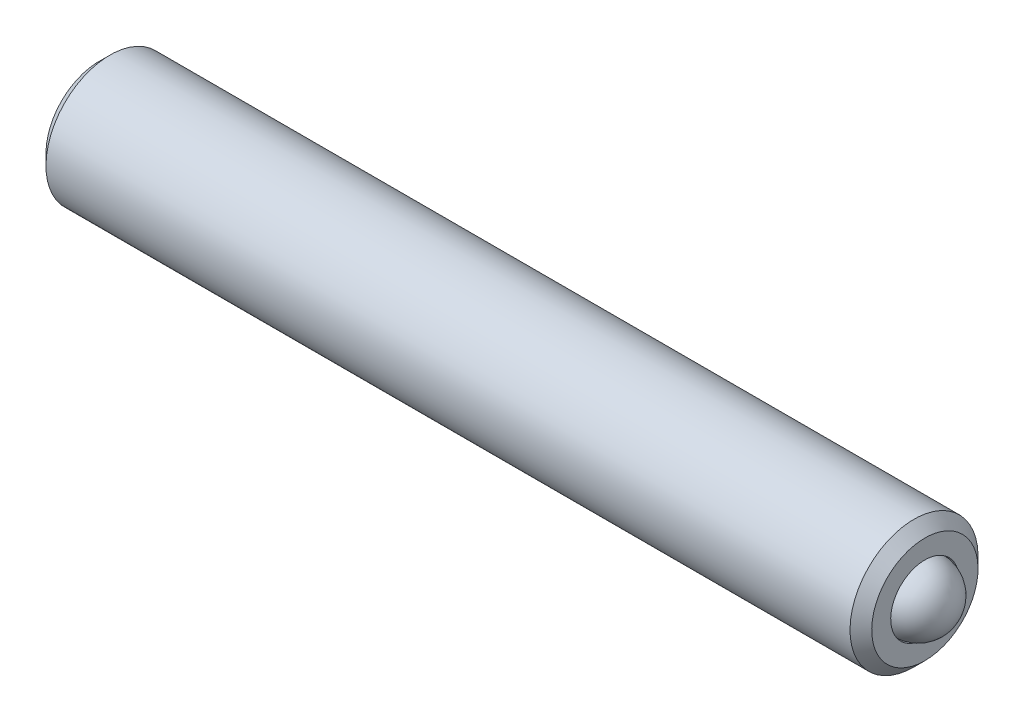
ISO-10303-21;
HEADER;
FILE_DESCRIPTION(('STEP AP214'),'2;1');
FILE_NAME('part.step','',(''),(''),'','','');
FILE_SCHEMA(('AUTOMOTIVE_DESIGN { 1 0 10303 214 1 1 1 1 }'));
ENDSEC;
DATA;
#1=APPLICATION_CONTEXT('core data for automotive mechanical design processes');
#2=APPLICATION_PROTOCOL_DEFINITION('international standard','automotive_design',2000,#1);
#3=PRODUCT_CONTEXT('',#1,'mechanical');
#4=PRODUCT('Part','Part','',(#3));
#5=PRODUCT_RELATED_PRODUCT_CATEGORY('part','',(#4));
#6=PRODUCT_DEFINITION_FORMATION('','',#4);
#7=PRODUCT_DEFINITION_CONTEXT('part definition',#1,'design');
#8=PRODUCT_DEFINITION('design','',#6,#7);
#9=PRODUCT_DEFINITION_SHAPE('','',#8);
#10=(LENGTH_UNIT() NAMED_UNIT(*) SI_UNIT(.MILLI.,.METRE.));
#11=(NAMED_UNIT(*) PLANE_ANGLE_UNIT() SI_UNIT($,.RADIAN.));
#12=(NAMED_UNIT(*) SI_UNIT($,.STERADIAN.) SOLID_ANGLE_UNIT());
#13=UNCERTAINTY_MEASURE_WITH_UNIT(LENGTH_MEASURE(1.E-05),#10,'distance_accuracy_value','');
#14=(GEOMETRIC_REPRESENTATION_CONTEXT(3) GLOBAL_UNCERTAINTY_ASSIGNED_CONTEXT((#13)) GLOBAL_UNIT_ASSIGNED_CONTEXT((#10,
#11,#12)) REPRESENTATION_CONTEXT('',''));
#15=CARTESIAN_POINT('',(0.,0.,0.));
#16=DIRECTION('',(0.,0.,1.));
#17=DIRECTION('',(1.,0.,0.));
#18=AXIS2_PLACEMENT_3D('',#15,#16,#17);
#19=CARTESIAN_POINT('',(-9.11632661303997,-31.3076582156983,10.0438104659588));
#20=DIRECTION('',(-1.,0.,0.));
#21=DIRECTION('',(0.,-1.,0.));
#22=AXIS2_PLACEMENT_3D('',#19,#20,#21);
#23=PLANE('',#22);
#24=CARTESIAN_POINT('',(-9.11632661303998,-15.4586747202075,10.0438104659588));
#25=DIRECTION('',(-1.,0.,0.));
#26=DIRECTION('',(0.,0.,1.));
#27=AXIS2_PLACEMENT_3D('',#24,#25,#26);
#28=CIRCLE('',#27,0.952500000000023);
#29=CARTESIAN_POINT('',(-9.11632661303998,-15.4586747202075,10.9963104659588));
#30=VERTEX_POINT('',#29);
#31=EDGE_CURVE('P0_E229',#30,#30,#28,.T.);
#32=ORIENTED_EDGE('',*,*,#31,.F.);
#33=EDGE_LOOP('',(#32));
#34=FACE_BOUND('',#33,.T.);
#35=CARTESIAN_POINT('',(-9.11632661303998,-15.4586747202075,10.0438104659588));
#36=DIRECTION('',(-1.,0.,0.));
#37=DIRECTION('',(0.,-1.,0.));
#38=AXIS2_PLACEMENT_3D('',#35,#36,#37);
#39=CIRCLE('',#38,1.24460000000001);
#40=CARTESIAN_POINT('',(-9.11632661303998,-16.7032747202075,10.0438104659588));
#41=VERTEX_POINT('',#40);
#42=EDGE_CURVE('P0_E102',#41,#41,#39,.T.);
#43=ORIENTED_EDGE('',*,*,#42,.T.);
#44=EDGE_LOOP('',(#43));
#45=FACE_BOUND('',#44,.T.);
#46=ADVANCED_FACE('P0_F17',(#34,#45),#23,.T.);
#47=CARTESIAN_POINT('',(8.93814137182635,-15.4586747202074,10.0438104659588));
#48=DIRECTION('',(1.,0.,0.));
#49=DIRECTION('',(0.,1.,0.));
#50=AXIS2_PLACEMENT_3D('',#47,#48,#49);
#51=CONICAL_SURFACE('',#50,0.,0.785398163397458);
#52=CARTESIAN_POINT('',(9.73824137182635,-15.4586747202074,10.0438104659588));
#53=DIRECTION('',(-1.,0.,0.));
#54=DIRECTION('',(0.,-1.,0.));
#55=AXIS2_PLACEMENT_3D('',#52,#53,#54);
#56=CIRCLE('',#55,0.800100000000015);
#57=CARTESIAN_POINT('',(9.73824137182635,-16.2587747202075,10.0438104659588));
#58=VERTEX_POINT('',#57);
#59=EDGE_CURVE('P0_E29',#58,#58,#56,.T.);
#60=ORIENTED_EDGE('',*,*,#59,.F.);
#61=EDGE_LOOP('',(#60));
#62=FACE_BOUND('',#61,.T.);
#63=CARTESIAN_POINT('',(8.93814137182635,-15.4586747202074,10.0438104659588));
#64=VERTEX_POINT('',#63);
#65=VERTEX_LOOP('',#64);
#66=FACE_BOUND('',#65,.T.);
#67=ADVANCED_FACE('P0_F121',(#62,#66),#51,.F.);
#68=CARTESIAN_POINT('',(-9.11632661303998,-15.4586747202075,10.0438104659588));
#69=DIRECTION('',(-1.,0.,0.));
#70=DIRECTION('',(0.,-1.,0.));
#71=AXIS2_PLACEMENT_3D('',#68,#69,#70);
#72=CYLINDRICAL_SURFACE('',#71,0.800100000000021);
#73=CARTESIAN_POINT('',(10.21942338696,-15.4586747202074,10.0438104659588));
#74=DIRECTION('',(-1.,0.,0.));
#75=DIRECTION('',(0.,-1.,0.));
#76=AXIS2_PLACEMENT_3D('',#73,#74,#75);
#77=CIRCLE('',#76,0.800100000000027);
#78=CARTESIAN_POINT('',(10.21942338696,-16.2587747202075,10.0438104659588));
#79=VERTEX_POINT('',#78);
#80=EDGE_CURVE('P0_E114',#79,#79,#77,.T.);
#81=ORIENTED_EDGE('',*,*,#80,.F.);
#82=EDGE_LOOP('',(#81));
#83=FACE_BOUND('',#82,.T.);
#84=ORIENTED_EDGE('',*,*,#59,.T.);
#85=EDGE_LOOP('',(#84));
#86=FACE_BOUND('',#85,.T.);
#87=ADVANCED_FACE('P0_F119',(#83,#86),#72,.F.);
#88=CARTESIAN_POINT('',(10.21942338696,-31.307658215698,10.0438104659588));
#89=DIRECTION('',(-1.,0.,0.));
#90=DIRECTION('',(0.,-1.,0.));
#91=AXIS2_PLACEMENT_3D('',#88,#89,#90);
#92=PLANE('',#91);
#93=CARTESIAN_POINT('',(10.21942338696,-15.4586747202074,10.0438104659588));
#94=DIRECTION('',(-1.,0.,0.));
#95=DIRECTION('',(0.,-1.,0.));
#96=AXIS2_PLACEMENT_3D('',#93,#94,#95);
#97=CIRCLE('',#96,1.24460000000001);
#98=CARTESIAN_POINT('',(10.21942338696,-16.7032747202075,10.0438104659588));
#99=VERTEX_POINT('',#98);
#100=EDGE_CURVE('P0_E111',#99,#99,#97,.T.);
#101=ORIENTED_EDGE('',*,*,#100,.F.);
#102=EDGE_LOOP('',(#101));
#103=FACE_BOUND('',#102,.T.);
#104=ORIENTED_EDGE('',*,*,#80,.T.);
#105=EDGE_LOOP('',(#104));
#106=FACE_BOUND('',#105,.T.);
#107=ADVANCED_FACE('P0_F128',(#103,#106),#92,.F.);
#108=CARTESIAN_POINT('',(10.21942338696,-15.4586747202074,10.0438104659588));
#109=DIRECTION('',(-1.,0.,0.));
#110=DIRECTION('',(0.,-1.,0.));
#111=AXIS2_PLACEMENT_3D('',#108,#109,#110);
#112=CONICAL_SURFACE('',#111,1.24460000000001,0.785398163397435);
#113=CARTESIAN_POINT('',(9.96542338696,-15.4586747202074,10.0438104659588));
#114=DIRECTION('',(-1.,0.,0.));
#115=DIRECTION('',(0.,-1.,0.));
#116=AXIS2_PLACEMENT_3D('',#113,#114,#115);
#117=CIRCLE('',#116,1.4986);
#118=CARTESIAN_POINT('',(9.96542338696,-16.9572747202074,10.0438104659588));
#119=VERTEX_POINT('',#118);
#120=EDGE_CURVE('P0_E108',#119,#119,#117,.T.);
#121=ORIENTED_EDGE('',*,*,#120,.F.);
#122=EDGE_LOOP('',(#121));
#123=FACE_BOUND('',#122,.T.);
#124=ORIENTED_EDGE('',*,*,#100,.T.);
#125=EDGE_LOOP('',(#124));
#126=FACE_BOUND('',#125,.T.);
#127=ADVANCED_FACE('P0_F135',(#123,#126),#112,.T.);
#128=CARTESIAN_POINT('',(-9.11632661303998,-15.4586747202075,10.0438104659588));
#129=DIRECTION('',(-1.,0.,0.));
#130=DIRECTION('',(0.,-1.,0.));
#131=AXIS2_PLACEMENT_3D('',#128,#129,#130);
#132=CYLINDRICAL_SURFACE('',#131,1.49860000000001);
#133=CARTESIAN_POINT('',(-8.86232661304,-15.4586747202075,10.0438104659588));
#134=DIRECTION('',(-1.,0.,0.));
#135=DIRECTION('',(0.,-1.,0.));
#136=AXIS2_PLACEMENT_3D('',#133,#134,#135);
#137=CIRCLE('',#136,1.49860000000002);
#138=CARTESIAN_POINT('',(-8.86232661304,-16.9572747202075,10.0438104659588));
#139=VERTEX_POINT('',#138);
#140=EDGE_CURVE('P0_E105',#139,#139,#137,.T.);
#141=ORIENTED_EDGE('',*,*,#140,.F.);
#142=EDGE_LOOP('',(#141));
#143=FACE_BOUND('',#142,.T.);
#144=ORIENTED_EDGE('',*,*,#120,.T.);
#145=EDGE_LOOP('',(#144));
#146=FACE_BOUND('',#145,.T.);
#147=ADVANCED_FACE('P0_F139',(#143,#146),#132,.T.);
#148=CARTESIAN_POINT('',(-9.11632661303998,-15.4586747202075,10.0438104659588));
#149=DIRECTION('',(1.,0.,0.));
#150=DIRECTION('',(0.,1.,0.));
#151=AXIS2_PLACEMENT_3D('',#148,#149,#150);
#152=CONICAL_SURFACE('',#151,1.24460000000001,0.785398163397501);
#153=ORIENTED_EDGE('',*,*,#140,.T.);
#154=EDGE_LOOP('',(#153));
#155=FACE_BOUND('',#154,.T.);
#156=ORIENTED_EDGE('',*,*,#42,.F.);
#157=EDGE_LOOP('',(#156));
#158=FACE_BOUND('',#157,.T.);
#159=ADVANCED_FACE('P0_F143',(#155,#158),#152,.T.);
#160=CARTESIAN_POINT('',(-9.11632661303998,-15.4586747202075,10.0438104659588));
#161=DIRECTION('',(-1.,0.,0.));
#162=DIRECTION('',(0.,0.,1.));
#163=AXIS2_PLACEMENT_3D('',#160,#161,#162);
#164=CONICAL_SURFACE('',#163,0.952500000000023,0.78539816339745);
#165=CARTESIAN_POINT('',(-8.91324210978124,-14.7092592501536,10.0436104659588));
#166=CARTESIAN_POINT('',(-8.90036552668412,-14.7221436917082,10.0659269733585));
#167=CARTESIAN_POINT('',(-8.88824360681818,-14.7352427617095,10.0886152281325));
#168=CARTESIAN_POINT('',(-8.8660478423221,-14.7619535243145,10.1348796260735));
#169=CARTESIAN_POINT('',(-8.8559863597231,-14.7755677618862,10.1584601772539));
#170=CARTESIAN_POINT('',(-8.83875279005604,-14.8030220192588,10.2060123459072));
#171=CARTESIAN_POINT('',(-8.83153730595256,-14.8168550074889,10.2299717843422));
#172=CARTESIAN_POINT('',(-8.82041116616375,-14.8448189375339,10.2784067319596));
#173=CARTESIAN_POINT('',(-8.81649222355141,-14.8589490401456,10.3028807875991));
#174=CARTESIAN_POINT('',(-8.81152027848902,-14.8934629424513,10.3626606199601));
#175=CARTESIAN_POINT('',(-8.81241981467698,-14.9139273587489,10.3981060287348));
#176=CARTESIAN_POINT('',(-8.82168835609727,-14.9544272337628,10.4682538699591));
#177=CARTESIAN_POINT('',(-8.83006851532351,-14.9744620061614,10.5029551136716));
#178=CARTESIAN_POINT('',(-8.85027759171018,-15.0096470609526,10.5638974162369));
#179=CARTESIAN_POINT('',(-8.86105231463503,-15.0249591014186,10.5904186482916));
#180=CARTESIAN_POINT('',(-8.88532522860185,-15.05498321834,10.6424219442519));
#181=CARTESIAN_POINT('',(-8.89881456058682,-15.069697063927,10.6679070723833));
#182=CARTESIAN_POINT('',(-8.91324210978125,-15.0841401902613,10.6929233010145));
#183=B_SPLINE_CURVE_WITH_KNOTS('',3,(#165,#166,#167,#168,#169,#170,#171,#172,#173,#174,#175,
#176,#177,#178,#179,#180,#181,#182),.UNSPECIFIED.,.F.,.F.,(4,2,2,2,2,2,2,2,4),(0.,
0.0864788641253348,0.173462284806161,0.259062693136943,0.344447268473221,0.466486555643631,
0.588708114182807,0.685962692863712,0.782904885826127),.UNSPECIFIED.);
#184=CARTESIAN_POINT('',(-8.91312661303994,-14.7093747202075,10.0438104659588));
#185=VERTEX_POINT('',#184);
#186=CARTESIAN_POINT('',(-8.91312661303995,-15.0840247202075,10.6927233010145));
#187=VERTEX_POINT('',#186);
#188=EDGE_CURVE('P0_E73',#185,#187,#183,.T.);
#189=ORIENTED_EDGE('',*,*,#188,.T.);
#190=CARTESIAN_POINT('',(-10.625365831982,-17.8331404409307,10.6927233010146));
#191=CARTESIAN_POINT('',(-10.5676233906691,-17.7732753543967,10.6927233010146));
#192=CARTESIAN_POINT('',(-10.5099544568804,-17.7133390335228,10.6927233010146));
#193=CARTESIAN_POINT('',(-10.394812634355,-17.5932722885365,10.6927233010146));
#194=CARTESIAN_POINT('',(-10.3373397562521,-17.5331418542297,10.6927233010146));
#195=CARTESIAN_POINT('',(-10.2224859996694,-17.4124743163553,10.6927233010146));
#196=CARTESIAN_POINT('',(-10.1651058198909,-17.3519365471764,10.6927233010146));
#197=CARTESIAN_POINT('',(-10.0506804651646,-17.2305496184344,10.6927233010145));
#198=CARTESIAN_POINT('',(-9.99363527654341,-17.1697004717732,10.6927233010145));
#199=CARTESIAN_POINT('',(-9.87285030409219,-17.0399113196522,10.6927233010145));
#200=CARTESIAN_POINT('',(-9.80917025165041,-16.9709156453989,10.6927233010145));
#201=CARTESIAN_POINT('',(-9.68262283886063,-16.8321624054756,10.6927233010145));
#202=CARTESIAN_POINT('',(-9.61975559128004,-16.7624047365126,10.6927233010145));
#203=CARTESIAN_POINT('',(-9.49539418508536,-16.6218832005999,10.6927233010145));
#204=CARTESIAN_POINT('',(-9.43389789106411,-16.551121227415,10.6927233010145));
#205=CARTESIAN_POINT('',(-9.31297282635876,-16.4078603499327,10.6927233010145));
#206=CARTESIAN_POINT('',(-9.25354342987335,-16.3353619827952,10.6927233010145));
#207=CARTESIAN_POINT('',(-9.16124131898772,-16.2166500294666,10.6927233010145));
#208=CARTESIAN_POINT('',(-9.12716145299634,-16.1713811088337,10.6927233010145));
#209=CARTESIAN_POINT('',(-9.06109231328958,-16.079191095272,10.6927233010145));
#210=CARTESIAN_POINT('',(-9.02910698039448,-16.0322671298609,10.6927233010145));
#211=CARTESIAN_POINT('',(-8.96925388706377,-15.9371815659038,10.6927233010145));
#212=CARTESIAN_POINT('',(-8.94131453850947,-15.8890657608937,10.6927233010145));
#213=CARTESIAN_POINT('',(-8.89117775254594,-15.7899851956988,10.6927233010145));
#214=CARTESIAN_POINT('',(-8.86895827956883,-15.7390323174389,10.6927233010145));
#215=CARTESIAN_POINT('',(-8.84086500723943,-15.6541543850305,10.6927233010145));
#216=CARTESIAN_POINT('',(-8.83199242909033,-15.621249431289,10.6927233010145));
#217=CARTESIAN_POINT('',(-8.81897483037496,-15.5545735546106,10.6927233010145));
#218=CARTESIAN_POINT('',(-8.81481688608121,-15.5208052597048,10.6927233010145));
#219=CARTESIAN_POINT('',(-8.81156103572243,-15.4453957674318,10.6927233010145));
#220=CARTESIAN_POINT('',(-8.81380762708482,-15.4036879375453,10.6927233010145));
#221=CARTESIAN_POINT('',(-8.82585350137422,-15.3212726784945,10.6927233010145));
#222=CARTESIAN_POINT('',(-8.83568593176981,-15.2805704511373,10.6927233010145));
#223=CARTESIAN_POINT('',(-8.85838039182137,-15.2092386381408,10.6927233010145));
#224=CARTESIAN_POINT('',(-8.87020379316485,-15.1782587618784,10.6927233010145));
#225=CARTESIAN_POINT('',(-8.89648430183203,-15.1174236567548,10.6927233010145));
#226=CARTESIAN_POINT('',(-8.91094357766406,-15.0875693784993,10.6927233010145));
#227=CARTESIAN_POINT('',(-8.94191965427765,-15.0285846038295,10.6927233010145));
#228=CARTESIAN_POINT('',(-8.95845556113873,-14.9994643133075,10.6927233010145));
#229=CARTESIAN_POINT('',(-8.99293362521959,-14.9420946784385,10.6927233010145));
#230=CARTESIAN_POINT('',(-9.01087516040214,-14.9138449564619,10.6927233010145));
#231=CARTESIAN_POINT('',(-9.05272883265954,-14.8505926862914,10.6927233010145));
#232=CARTESIAN_POINT('',(-9.07695646509125,-14.8158001535954,10.6927233010145));
#233=CARTESIAN_POINT('',(-9.12659192432341,-14.7470637044818,10.6927233010145));
#234=CARTESIAN_POINT('',(-9.15200001675405,-14.7131199817347,10.6927233010145));
#235=CARTESIAN_POINT('',(-9.22952501427839,-14.6122110344901,10.6927233010145));
#236=CARTESIAN_POINT('',(-9.28290618483535,-14.5462207483016,10.6927233010145));
#237=CARTESIAN_POINT('',(-9.39174266038033,-14.4156142258401,10.6927233010145));
#238=CARTESIAN_POINT('',(-9.44720447535384,-14.3510035043303,10.6927233010145));
#239=CARTESIAN_POINT('',(-9.55930313647575,-14.2228636229378,10.6927233010144));
#240=CARTESIAN_POINT('',(-9.61593943668301,-14.1593339844708,10.6927233010144));
#241=CARTESIAN_POINT('',(-9.72369583057836,-14.039984095558,10.6927233010144));
#242=CARTESIAN_POINT('',(-9.7747329297823,-13.98408856777,10.6927233010144));
#243=CARTESIAN_POINT('',(-9.87727186214808,-13.8727115978055,10.6927233010144));
#244=CARTESIAN_POINT('',(-9.92877375805026,-13.8172302134361,10.6927233010144));
#245=CARTESIAN_POINT('',(-10.0317734845372,-13.7069544109589,10.6927233010144));
#246=CARTESIAN_POINT('',(-10.0832690553368,-13.6521578787545,10.6927233010144));
#247=CARTESIAN_POINT('',(-10.1865141787423,-13.5428216802844,10.6927233010144));
#248=CARTESIAN_POINT('',(-10.2382636878373,-13.4882819729497,10.6927233010144));
#249=CARTESIAN_POINT('',(-10.2901078416566,-13.4338329990679,10.6927233010144));
#250=B_SPLINE_CURVE_WITH_KNOTS('',3,(#190,#191,#192,#193,#194,#195,#196,#197,#198,#199,#200,
#201,#202,#203,#204,#205,#206,#207,#208,#209,#210,#211,#212,#213,#214,#215,#216,#217,#218,#219,
#220,#221,#222,#223,#224,#225,#226,#227,#228,#229,#230,#231,#232,#233,#234,#235,#236,#237,#238,
#239,#240,#241,#242,#243,#244,#245,#246,#247,#248,#249),.UNSPECIFIED.,.F.,.F.,(4,2,2,2,2,2,2,2,
2,2,2,2,2,2,2,2,2,2,2,2,2,2,2,2,2,2,2,2,2,4),(0.,0.24952416944401,0.4990616640489,
0.749292126030621,0.999512302282482,1.28118188446105,1.56289013456254,1.8441236464603,
2.12527125365804,2.29522422452397,2.46548827885784,2.63222422359163,2.7983078735179,
2.90027530295208,3.00196253895412,3.12646325295125,3.25151109444024,3.35084711072832,
3.45026522165719,3.55067620712131,3.6510430056943,3.77819720424608,3.90538015527501,
4.15993807573824,4.41537266799788,4.67069107504129,4.89776066228902,5.12486137303368,
5.35044877312682,5.57599878315974),.UNSPECIFIED.);
#251=CARTESIAN_POINT('',(-8.91312661303996,-15.8333247202074,10.6927233010145));
#252=VERTEX_POINT('',#251);
#253=EDGE_CURVE('P0_E87',#187,#252,#250,.F.);
#254=ORIENTED_EDGE('',*,*,#253,.T.);
#255=CARTESIAN_POINT('',(-8.91324210978127,-15.8332092501536,10.6929233010145));
#256=CARTESIAN_POINT('',(-8.90036552668414,-15.8460936917082,10.6706067936148));
#257=CARTESIAN_POINT('',(-8.8882436068182,-15.8591927617094,10.6479185388408));
#258=CARTESIAN_POINT('',(-8.86604784232212,-15.8859035243145,10.6016541408998));
#259=CARTESIAN_POINT('',(-8.85598635972311,-15.8995177618862,10.5780735897194));
#260=CARTESIAN_POINT('',(-8.83875279005606,-15.9269720192587,10.530521421066));
#261=CARTESIAN_POINT('',(-8.83153730595257,-15.9408050074888,10.506561982631));
#262=CARTESIAN_POINT('',(-8.82041116616376,-15.9687689375339,10.4581270350137));
#263=CARTESIAN_POINT('',(-8.81649222355142,-15.9828990401455,10.4336529793741));
#264=CARTESIAN_POINT('',(-8.81152027848903,-16.0174129424513,10.3738731470132));
#265=CARTESIAN_POINT('',(-8.81241981467699,-16.0378773587488,10.3384277382385));
#266=CARTESIAN_POINT('',(-8.82168835609728,-16.0783772337628,10.2682798970141));
#267=CARTESIAN_POINT('',(-8.83006851532352,-16.0984120061614,10.2335786533017));
#268=CARTESIAN_POINT('',(-8.85027759171019,-16.1335970609525,10.1726363507363));
#269=CARTESIAN_POINT('',(-8.86105231463504,-16.1489091014186,10.1461151186816));
#270=CARTESIAN_POINT('',(-8.88532522860186,-16.17893321834,10.0941118227214));
#271=CARTESIAN_POINT('',(-8.89881456058682,-16.1936470639269,10.06862669459));
#272=CARTESIAN_POINT('',(-8.91324210978125,-16.2080901902613,10.0436104659588));
#273=B_SPLINE_CURVE_WITH_KNOTS('',3,(#255,#256,#257,#258,#259,#260,#261,#262,#263,#264,#265,
#266,#267,#268,#269,#270,#271,#272),.UNSPECIFIED.,.F.,.F.,(4,2,2,2,2,2,2,2,4),(0.,
0.0864788641253455,0.173462284806181,0.259062693136974,0.344447268473259,0.46648655564367,
0.588708114182849,0.685962692863737,0.78290488582614),.UNSPECIFIED.);
#274=CARTESIAN_POINT('',(-8.91312661303994,-16.2079747202074,10.0438104659588));
#275=VERTEX_POINT('',#274);
#276=EDGE_CURVE('P0_E184',#252,#275,#273,.T.);
#277=ORIENTED_EDGE('',*,*,#276,.T.);
#278=CARTESIAN_POINT('',(-8.91324210978122,-15.8332092501536,9.39469763090316));
#279=CARTESIAN_POINT('',(-8.9003655266841,-15.8460936917082,9.41701413830287));
#280=CARTESIAN_POINT('',(-8.88824360681816,-15.8591927617094,9.4397023930769));
#281=CARTESIAN_POINT('',(-8.86604784232209,-15.8859035243145,9.48596679101782));
#282=CARTESIAN_POINT('',(-8.85598635972309,-15.8995177618862,9.50954734219826));
#283=CARTESIAN_POINT('',(-8.83875279005604,-15.9269720192587,9.55709951085159));
#284=CARTESIAN_POINT('',(-8.83153730595255,-15.9408050074888,9.58105894928659));
#285=CARTESIAN_POINT('',(-8.82041116616374,-15.9687689375339,9.62949389690396));
#286=CARTESIAN_POINT('',(-8.81649222355141,-15.9828990401455,9.65396795254348));
#287=CARTESIAN_POINT('',(-8.81152027848902,-16.0174129424513,9.71374778490445));
#288=CARTESIAN_POINT('',(-8.81241981467698,-16.0378773587488,9.74919319367911));
#289=CARTESIAN_POINT('',(-8.82168835609727,-16.0783772337628,9.81934103490348));
#290=CARTESIAN_POINT('',(-8.83006851532351,-16.0984120061614,9.85404227861596));
#291=CARTESIAN_POINT('',(-8.85027759171018,-16.1335970609525,9.91498458118127));
#292=CARTESIAN_POINT('',(-8.86105231463503,-16.1489091014186,9.94150581323598));
#293=CARTESIAN_POINT('',(-8.88532522860185,-16.17893321834,9.99350910919622));
#294=CARTESIAN_POINT('',(-8.89881456058681,-16.1936470639269,10.0189942373276));
#295=CARTESIAN_POINT('',(-8.91324210978125,-16.2080901902613,10.0440104659588));
#296=B_SPLINE_CURVE_WITH_KNOTS('',3,(#278,#279,#280,#281,#282,#283,#284,#285,#286,#287,#288,
#289,#290,#291,#292,#293,#294,#295),.UNSPECIFIED.,.F.,.F.,(4,2,2,2,2,2,2,2,4),(0.,
0.0864788641253269,0.173462284806145,0.259062693136922,0.344447268473193,0.466486555643602,
0.588708114182777,0.68596269286368,0.78290488582609),.UNSPECIFIED.);
#297=CARTESIAN_POINT('',(-8.91312661303992,-15.8333247202075,9.39489763090316));
#298=VERTEX_POINT('',#297);
#299=EDGE_CURVE('P0_E179',#298,#275,#296,.T.);
#300=ORIENTED_EDGE('',*,*,#299,.F.);
#301=CARTESIAN_POINT('',(-10.625365831982,-17.8331404409307,9.39489763090316));
#302=CARTESIAN_POINT('',(-10.5676233906691,-17.7732753543968,9.39489763090316));
#303=CARTESIAN_POINT('',(-10.5099544568804,-17.7133390335228,9.39489763090316));
#304=CARTESIAN_POINT('',(-10.394812634355,-17.5932722885366,9.39489763090316));
#305=CARTESIAN_POINT('',(-10.337339756252,-17.5331418542297,9.39489763090316));
#306=CARTESIAN_POINT('',(-10.2224859996694,-17.4124743163553,9.39489763090316));
#307=CARTESIAN_POINT('',(-10.1651058198908,-17.3519365471764,9.39489763090316));
#308=CARTESIAN_POINT('',(-10.0506804651645,-17.2305496184344,9.39489763090316));
#309=CARTESIAN_POINT('',(-9.99363527654337,-17.1697004717732,9.39489763090316));
#310=CARTESIAN_POINT('',(-9.87285030409213,-17.0399113196522,9.39489763090316));
#311=CARTESIAN_POINT('',(-9.80917025165036,-16.9709156453988,9.39489763090316));
#312=CARTESIAN_POINT('',(-9.68262283886056,-16.8321624054756,9.39489763090316));
#313=CARTESIAN_POINT('',(-9.61975559127997,-16.7624047365126,9.39489763090316));
#314=CARTESIAN_POINT('',(-9.49539418508528,-16.6218832005998,9.39489763090316));
#315=CARTESIAN_POINT('',(-9.43389789106403,-16.5511212274149,9.39489763090316));
#316=CARTESIAN_POINT('',(-9.31297282635867,-16.4078603499326,9.39489763090316));
#317=CARTESIAN_POINT('',(-9.25354342987325,-16.3353619827951,9.39489763090316));
#318=CARTESIAN_POINT('',(-9.16124131898763,-16.2166500294666,9.39489763090316));
#319=CARTESIAN_POINT('',(-9.12716145299625,-16.1713811088337,9.39489763090316));
#320=CARTESIAN_POINT('',(-9.0610923132895,-16.079191095272,9.39489763090316));
#321=CARTESIAN_POINT('',(-9.0291069803944,-16.0322671298609,9.39489763090316));
#322=CARTESIAN_POINT('',(-8.96925388706371,-15.9371815659038,9.39489763090316));
#323=CARTESIAN_POINT('',(-8.94131453850941,-15.8890657608937,9.39489763090316));
#324=CARTESIAN_POINT('',(-8.89117775254589,-15.7899851956988,9.39489763090316));
#325=CARTESIAN_POINT('',(-8.86895827956878,-15.7390323174389,9.39489763090316));
#326=CARTESIAN_POINT('',(-8.84086500723938,-15.6541543850305,9.39489763090316));
#327=CARTESIAN_POINT('',(-8.83199242909028,-15.621249431289,9.39489763090316));
#328=CARTESIAN_POINT('',(-8.81897483037491,-15.5545735546106,9.39489763090316));
#329=CARTESIAN_POINT('',(-8.81481688608115,-15.5208052597048,9.39489763090316));
#330=CARTESIAN_POINT('',(-8.81156103572237,-15.4453957674319,9.39489763090316));
#331=CARTESIAN_POINT('',(-8.81380762708477,-15.4036879375454,9.39489763090316));
#332=CARTESIAN_POINT('',(-8.82585350137416,-15.3212726784946,9.39489763090316));
#333=CARTESIAN_POINT('',(-8.83568593176975,-15.2805704511374,9.39489763090316));
#334=CARTESIAN_POINT('',(-8.85838039182131,-15.2092386381409,9.39489763090316));
#335=CARTESIAN_POINT('',(-8.87020379316478,-15.1782587618785,9.39489763090316));
#336=CARTESIAN_POINT('',(-8.89648430183196,-15.1174236567549,9.39489763090316));
#337=CARTESIAN_POINT('',(-8.91094357766399,-15.0875693784994,9.39489763090316));
#338=CARTESIAN_POINT('',(-8.94191965427757,-15.0285846038296,9.39489763090316));
#339=CARTESIAN_POINT('',(-8.95845556113865,-14.9994643133076,9.39489763090316));
#340=CARTESIAN_POINT('',(-8.9929336252195,-14.9420946784386,9.39489763090316));
#341=CARTESIAN_POINT('',(-9.01087516040205,-14.913844956462,9.39489763090316));
#342=CARTESIAN_POINT('',(-9.05272883265945,-14.8505926862915,9.39489763090316));
#343=CARTESIAN_POINT('',(-9.07695646509116,-14.8158001535955,9.39489763090316));
#344=CARTESIAN_POINT('',(-9.12659192432331,-14.7470637044819,9.39489763090316));
#345=CARTESIAN_POINT('',(-9.15200001675395,-14.7131199817349,9.39489763090316));
#346=CARTESIAN_POINT('',(-9.22952501427827,-14.6122110344902,9.39489763090316));
#347=CARTESIAN_POINT('',(-9.28290618483523,-14.5462207483017,9.39489763090316));
#348=CARTESIAN_POINT('',(-9.39174266038019,-14.4156142258402,9.39489763090316));
#349=CARTESIAN_POINT('',(-9.44720447535369,-14.3510035043304,9.39489763090316));
#350=CARTESIAN_POINT('',(-9.55930313647559,-14.222863622938,9.39489763090316));
#351=CARTESIAN_POINT('',(-9.61593943668284,-14.159333984471,9.39489763090316));
#352=CARTESIAN_POINT('',(-9.72369583057817,-14.0399840955582,9.39489763090316));
#353=CARTESIAN_POINT('',(-9.77473292978211,-13.9840885677702,9.39489763090316));
#354=CARTESIAN_POINT('',(-9.87727186214787,-13.8727115978057,9.39489763090316));
#355=CARTESIAN_POINT('',(-9.92877375805004,-13.8172302134364,9.39489763090316));
#356=CARTESIAN_POINT('',(-10.031773484537,-13.7069544109592,9.39489763090316));
#357=CARTESIAN_POINT('',(-10.0832690553365,-13.6521578787548,9.39489763090316));
#358=CARTESIAN_POINT('',(-10.1865141787421,-13.5428216802847,9.39489763090316));
#359=CARTESIAN_POINT('',(-10.2382636878371,-13.48828197295,9.39489763090316));
#360=CARTESIAN_POINT('',(-10.2901078416563,-13.4338329990682,9.39489763090316));
#361=B_SPLINE_CURVE_WITH_KNOTS('',3,(#301,#302,#303,#304,#305,#306,#307,#308,#309,#310,#311,
#312,#313,#314,#315,#316,#317,#318,#319,#320,#321,#322,#323,#324,#325,#326,#327,#328,#329,#330,
#331,#332,#333,#334,#335,#336,#337,#338,#339,#340,#341,#342,#343,#344,#345,#346,#347,#348,#349,
#350,#351,#352,#353,#354,#355,#356,#357,#358,#359,#360),.UNSPECIFIED.,.F.,.F.,(4,2,2,2,2,2,2,2,
2,2,2,2,2,2,2,2,2,2,2,2,2,2,2,2,2,2,2,2,2,4),(0.,0.24952416944403,0.499061664048934,
0.749292126030675,0.999512302282552,1.28118188446114,1.56289013456265,1.84412364646043,
2.12527125365819,2.29522422452409,2.46548827885793,2.63222422359169,2.79830787351794,
2.90027530295211,3.00196253895414,3.12646325295126,3.25151109444025,3.35084711072832,
3.45026522165718,3.55067620712128,3.65104300569426,3.77819720424603,3.90538015527494,
4.15993807573814,4.41537266799773,4.67069107504112,4.89776066228881,5.12486137303344,
5.35044877312655,5.57599878315943),.UNSPECIFIED.);
#362=CARTESIAN_POINT('',(-8.91312661303992,-15.0840247202075,9.39489763090316));
#363=VERTEX_POINT('',#362);
#364=EDGE_CURVE('P0_E36',#363,#298,#361,.F.);
#365=ORIENTED_EDGE('',*,*,#364,.F.);
#366=CARTESIAN_POINT('',(-8.91324210978124,-14.7092592501536,10.0440104659588));
#367=CARTESIAN_POINT('',(-8.90036552668412,-14.7221436917082,10.0216939585591));
#368=CARTESIAN_POINT('',(-8.88824360681818,-14.7352427617095,9.99900570378506));
#369=CARTESIAN_POINT('',(-8.8660478423221,-14.7619535243145,9.95274130584414));
#370=CARTESIAN_POINT('',(-8.8559863597231,-14.7755677618862,9.92916075466369));
#371=CARTESIAN_POINT('',(-8.83875279005605,-14.8030220192588,9.88160858601036));
#372=CARTESIAN_POINT('',(-8.83153730595256,-14.8168550074889,9.85764914757536));
#373=CARTESIAN_POINT('',(-8.82041116616375,-14.8448189375339,9.80921419995799));
#374=CARTESIAN_POINT('',(-8.81649222355141,-14.8589490401456,9.78474014431846));
#375=CARTESIAN_POINT('',(-8.81152027848902,-14.8934629424513,9.72496031195749));
#376=CARTESIAN_POINT('',(-8.81241981467698,-14.9139273587489,9.68951490318283));
#377=CARTESIAN_POINT('',(-8.82168835609727,-14.9544272337628,9.61936706195847));
#378=CARTESIAN_POINT('',(-8.83006851532351,-14.9744620061614,9.58466581824598));
#379=CARTESIAN_POINT('',(-8.85027759171018,-15.0096470609526,9.52372351568068));
#380=CARTESIAN_POINT('',(-8.86105231463503,-15.0249591014186,9.49720228362597));
#381=CARTESIAN_POINT('',(-8.88532522860184,-15.05498321834,9.44519898766574));
#382=CARTESIAN_POINT('',(-8.8988145605868,-15.069697063927,9.41971385953436));
#383=CARTESIAN_POINT('',(-8.91324210978122,-15.0841401902613,9.39469763090316));
#384=B_SPLINE_CURVE_WITH_KNOTS('',3,(#366,#367,#368,#369,#370,#371,#372,#373,#374,#375,#376,
#377,#378,#379,#380,#381,#382,#383),.UNSPECIFIED.,.F.,.F.,(4,2,2,2,2,2,2,2,4),(0.,
0.0864788641253319,0.173462284806158,0.25906269313694,0.34444726847322,0.46648655564363,
0.588708114182806,0.685962692863685,0.782904885826073),.UNSPECIFIED.);
#385=EDGE_CURVE('P0_E11',#185,#363,#384,.T.);
#386=ORIENTED_EDGE('',*,*,#385,.F.);
#387=EDGE_LOOP('',(#189,#254,#277,#300,#365,#386));
#388=FACE_BOUND('',#387,.T.);
#389=ORIENTED_EDGE('',*,*,#31,.T.);
#390=EDGE_LOOP('',(#389));
#391=FACE_BOUND('',#390,.T.);
#392=ADVANCED_FACE('P0_F71',(#388,#391),#164,.F.);
#393=CARTESIAN_POINT('',(-6.06832661303998,-18.3382160764448,10.0438104659588));
#394=DIRECTION('',(-1.,0.,0.));
#395=DIRECTION('',(0.,-1.,0.));
#396=AXIS2_PLACEMENT_3D('',#393,#394,#395);
#397=PLANE('',#396);
#398=DIRECTION('',(0.,-0.500000000000001,0.866025403784438));
#399=VECTOR('',#398,1.);
#400=CARTESIAN_POINT('',(-6.06832661303998,-15.6165850592668,11.6151448663614));
#401=LINE('',#400,#399);
#402=CARTESIAN_POINT('',(-6.06832661303998,-14.7093747202075,10.0438104659588));
#403=VERTEX_POINT('',#402);
#404=CARTESIAN_POINT('',(-6.06832661303998,-15.0840247202075,10.6927233010145));
#405=VERTEX_POINT('',#404);
#406=EDGE_CURVE('P0_E86',#403,#405,#401,.T.);
#407=ORIENTED_EDGE('',*,*,#406,.F.);
#408=DIRECTION('',(0.,-0.500000000000001,-0.866025403784438));
#409=VECTOR('',#408,1.);
#410=CARTESIAN_POINT('',(-6.06832661303998,-15.6165850592668,8.47247606555626));
#411=LINE('',#410,#409);
#412=CARTESIAN_POINT('',(-6.06832661303998,-15.0840247202074,9.39489763090316));
#413=VERTEX_POINT('',#412);
#414=EDGE_CURVE('P0_E92',#403,#413,#411,.T.);
#415=ORIENTED_EDGE('',*,*,#414,.T.);
#416=DIRECTION('',(0.,-1.,0.));
#417=VECTOR('',#416,1.);
#418=CARTESIAN_POINT('',(-6.06832661303998,-18.3382160764448,9.39489763090316));
#419=LINE('',#418,#417);
#420=CARTESIAN_POINT('',(-6.06832661303998,-15.8333247202075,9.39489763090316));
#421=VERTEX_POINT('',#420);
#422=EDGE_CURVE('P0_E208',#413,#421,#419,.T.);
#423=ORIENTED_EDGE('',*,*,#422,.T.);
#424=DIRECTION('',(0.,-0.5,0.866025403784439));
#425=VECTOR('',#424,1.);
#426=CARTESIAN_POINT('',(-6.06832661303998,-16.7405350592668,10.9662320313057));
#427=LINE('',#426,#425);
#428=CARTESIAN_POINT('',(-6.06832661303998,-16.2079747202074,10.0438104659588));
#429=VERTEX_POINT('',#428);
#430=EDGE_CURVE('P0_E212',#421,#429,#427,.T.);
#431=ORIENTED_EDGE('',*,*,#430,.T.);
#432=DIRECTION('',(0.,-0.5,-0.866025403784439));
#433=VECTOR('',#432,1.);
#434=CARTESIAN_POINT('',(-6.06832661303998,-16.7405350592668,9.12138890061193));
#435=LINE('',#434,#433);
#436=CARTESIAN_POINT('',(-6.06832661303998,-15.8333247202074,10.6927233010145));
#437=VERTEX_POINT('',#436);
#438=EDGE_CURVE('P0_E98',#437,#429,#435,.T.);
#439=ORIENTED_EDGE('',*,*,#438,.F.);
#440=DIRECTION('',(0.,-1.,0.));
#441=VECTOR('',#440,1.);
#442=CARTESIAN_POINT('',(-6.06832661303998,-18.3382160764448,10.6927233010146));
#443=LINE('',#442,#441);
#444=EDGE_CURVE('P0_E94',#405,#437,#443,.T.);
#445=ORIENTED_EDGE('',*,*,#444,.F.);
#446=EDGE_LOOP('',(#407,#415,#423,#431,#439,#445));
#447=FACE_BOUND('',#446,.T.);
#448=ADVANCED_FACE('P0_F167',(#447),#397,.T.);
#449=CARTESIAN_POINT('',(-6.06832661303998,-15.6165850592668,8.47247606555626));
#450=DIRECTION('',(0.,0.866025403784438,-0.500000000000001));
#451=DIRECTION('',(0.,0.500000000000001,0.866025403784438));
#452=AXIS2_PLACEMENT_3D('',#449,#450,#451);
#453=PLANE('',#452);
#454=DIRECTION('',(-1.,0.,0.));
#455=VECTOR('',#454,1.);
#456=CARTESIAN_POINT('',(-6.06832661303998,-14.7093747202075,10.0438104659588));
#457=LINE('',#456,#455);
#458=EDGE_CURVE('P0_E82',#403,#185,#457,.T.);
#459=ORIENTED_EDGE('',*,*,#458,.T.);
#460=ORIENTED_EDGE('',*,*,#385,.T.);
#461=DIRECTION('',(-1.,0.,0.));
#462=VECTOR('',#461,1.);
#463=CARTESIAN_POINT('',(-6.06832661303998,-15.0840247202074,9.39489763090316));
#464=LINE('',#463,#462);
#465=EDGE_CURVE('P0_E93',#413,#363,#464,.T.);
#466=ORIENTED_EDGE('',*,*,#465,.F.);
#467=ORIENTED_EDGE('',*,*,#414,.F.);
#468=EDGE_LOOP('',(#459,#460,#466,#467));
#469=FACE_BOUND('',#468,.T.);
#470=ADVANCED_FACE('P0_F90',(#469),#453,.F.);
#471=CARTESIAN_POINT('',(-6.06832661303998,-18.3382160764448,9.39489763090316));
#472=DIRECTION('',(0.,0.,-1.));
#473=DIRECTION('',(-1.,0.,0.));
#474=AXIS2_PLACEMENT_3D('',#471,#472,#473);
#475=PLANE('',#474);
#476=ORIENTED_EDGE('',*,*,#465,.T.);
#477=ORIENTED_EDGE('',*,*,#364,.T.);
#478=DIRECTION('',(-1.,0.,0.));
#479=VECTOR('',#478,1.);
#480=CARTESIAN_POINT('',(-6.06832661303998,-15.8333247202075,9.39489763090316));
#481=LINE('',#480,#479);
#482=EDGE_CURVE('P0_E96',#421,#298,#481,.T.);
#483=ORIENTED_EDGE('',*,*,#482,.F.);
#484=ORIENTED_EDGE('',*,*,#422,.F.);
#485=EDGE_LOOP('',(#476,#477,#483,#484));
#486=FACE_BOUND('',#485,.T.);
#487=ADVANCED_FACE('P0_F197',(#486),#475,.F.);
#488=CARTESIAN_POINT('',(-6.06832661303998,-16.7405350592668,10.9662320313057));
#489=DIRECTION('',(0.,-0.866025403784439,-0.5));
#490=DIRECTION('',(0.,0.5,-0.866025403784439));
#491=AXIS2_PLACEMENT_3D('',#488,#489,#490);
#492=PLANE('',#491);
#493=ORIENTED_EDGE('',*,*,#482,.T.);
#494=ORIENTED_EDGE('',*,*,#299,.T.);
#495=DIRECTION('',(-1.,0.,0.));
#496=VECTOR('',#495,1.);
#497=CARTESIAN_POINT('',(-6.06832661303998,-16.2079747202074,10.0438104659588));
#498=LINE('',#497,#496);
#499=EDGE_CURVE('P0_E221',#429,#275,#498,.T.);
#500=ORIENTED_EDGE('',*,*,#499,.F.);
#501=ORIENTED_EDGE('',*,*,#430,.F.);
#502=EDGE_LOOP('',(#493,#494,#500,#501));
#503=FACE_BOUND('',#502,.T.);
#504=ADVANCED_FACE('P0_F192',(#503),#492,.F.);
#505=CARTESIAN_POINT('',(-6.06832661303998,-16.7405350592668,9.12138890061193));
#506=DIRECTION('',(0.,0.866025403784439,-0.5));
#507=DIRECTION('',(0.,0.5,0.866025403784439));
#508=AXIS2_PLACEMENT_3D('',#505,#506,#507);
#509=PLANE('',#508);
#510=ORIENTED_EDGE('',*,*,#276,.F.);
#511=DIRECTION('',(-1.,0.,0.));
#512=VECTOR('',#511,1.);
#513=CARTESIAN_POINT('',(-6.06832661303998,-15.8333247202074,10.6927233010145));
#514=LINE('',#513,#512);
#515=EDGE_CURVE('P0_E218',#437,#252,#514,.T.);
#516=ORIENTED_EDGE('',*,*,#515,.F.);
#517=ORIENTED_EDGE('',*,*,#438,.T.);
#518=ORIENTED_EDGE('',*,*,#499,.T.);
#519=EDGE_LOOP('',(#510,#516,#517,#518));
#520=FACE_BOUND('',#519,.T.);
#521=ADVANCED_FACE('P0_F189',(#520),#509,.T.);
#522=CARTESIAN_POINT('',(-6.06832661303998,-18.3382160764448,10.6927233010146));
#523=DIRECTION('',(0.,0.,-1.));
#524=DIRECTION('',(0.,1.,0.));
#525=AXIS2_PLACEMENT_3D('',#522,#523,#524);
#526=PLANE('',#525);
#527=ORIENTED_EDGE('',*,*,#253,.F.);
#528=DIRECTION('',(-1.,0.,0.));
#529=VECTOR('',#528,1.);
#530=CARTESIAN_POINT('',(-6.06832661303998,-15.0840247202075,10.6927233010145));
#531=LINE('',#530,#529);
#532=EDGE_CURVE('P0_E85',#405,#187,#531,.T.);
#533=ORIENTED_EDGE('',*,*,#532,.F.);
#534=ORIENTED_EDGE('',*,*,#444,.T.);
#535=ORIENTED_EDGE('',*,*,#515,.T.);
#536=EDGE_LOOP('',(#527,#533,#534,#535));
#537=FACE_BOUND('',#536,.T.);
#538=ADVANCED_FACE('P0_F150',(#537),#526,.T.);
#539=CARTESIAN_POINT('',(-6.06832661303998,-15.6165850592668,11.6151448663614));
#540=DIRECTION('',(0.,-0.866025403784438,-0.500000000000001));
#541=DIRECTION('',(0.,0.500000000000001,-0.866025403784438));
#542=AXIS2_PLACEMENT_3D('',#539,#540,#541);
#543=PLANE('',#542);
#544=ORIENTED_EDGE('',*,*,#188,.F.);
#545=ORIENTED_EDGE('',*,*,#458,.F.);
#546=ORIENTED_EDGE('',*,*,#406,.T.);
#547=ORIENTED_EDGE('',*,*,#532,.T.);
#548=EDGE_LOOP('',(#544,#545,#546,#547));
#549=FACE_BOUND('',#548,.T.);
#550=ADVANCED_FACE('P0_F80',(#549),#543,.T.);
#551=CLOSED_SHELL('',(#46,#67,#87,#107,#127,#147,#159,#392,#448,#470,#487,#504,#521,#538,#550));
#552=MANIFOLD_SOLID_BREP('P0_B1',#551);
#553=CARTESIAN_POINT('',(10.06067338696,-15.4586747202074,10.0438104659588));
#554=DIRECTION('',(-1.,0.,0.));
#555=DIRECTION('',(0.,-1.,0.));
#556=AXIS2_PLACEMENT_3D('',#553,#554,#555);
#557=SPHERICAL_SURFACE('',#556,0.79375000000001);
#558=CARTESIAN_POINT('',(9.26692338695996,-15.4586747202074,10.0438104659588));
#559=VERTEX_POINT('',#558);
#560=VERTEX_LOOP('',#559);
#561=FACE_BOUND('',#560,.T.);
#562=ADVANCED_FACE('P1_F12',(#561),#557,.T.);
#563=CLOSED_SHELL('',(#562));
#564=MANIFOLD_SOLID_BREP('P1_B1',#563);
#565=ADVANCED_BREP_SHAPE_REPRESENTATION('',(#18,#552,#564),#14);
#566=SHAPE_DEFINITION_REPRESENTATION(#9,#565);
ENDSEC;
END-ISO-10303-21;
